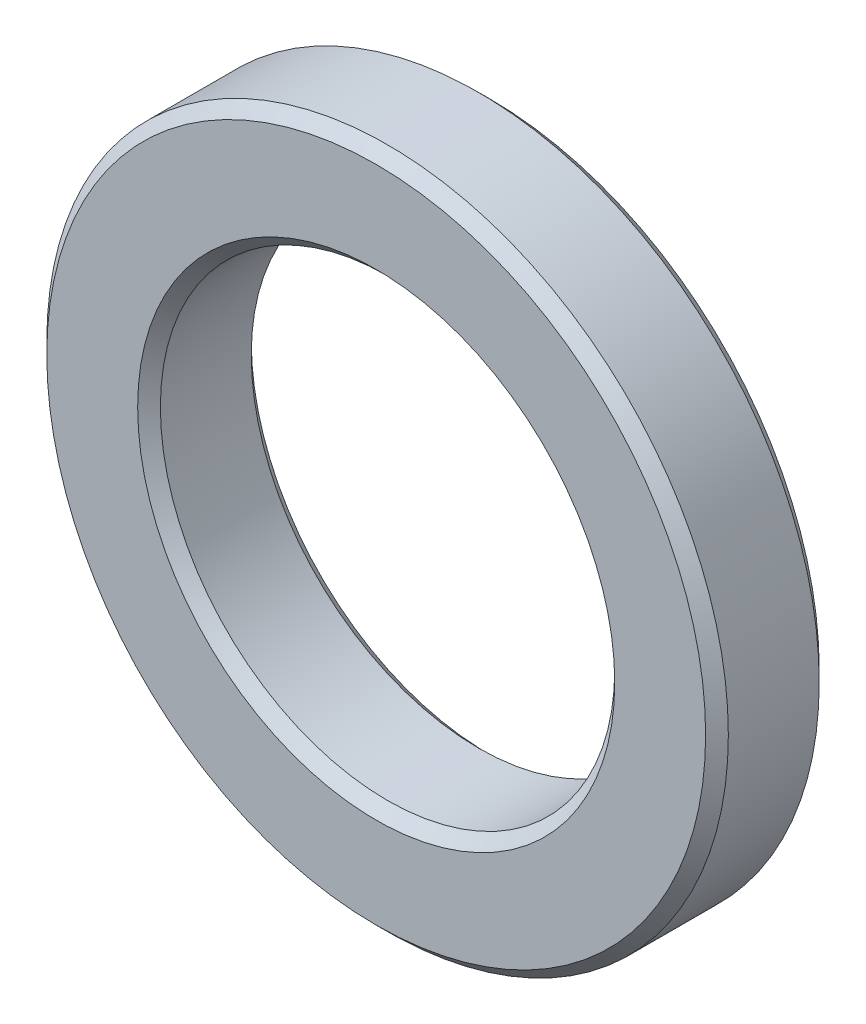
ISO-10303-21;
HEADER;
FILE_DESCRIPTION(('STEP AP214'),'2;1');
FILE_NAME('part.step','',(''),(''),'','','');
FILE_SCHEMA(('AUTOMOTIVE_DESIGN { 1 0 10303 214 1 1 1 1 }'));
ENDSEC;
DATA;
#1=APPLICATION_CONTEXT('core data for automotive mechanical design processes');
#2=APPLICATION_PROTOCOL_DEFINITION('international standard','automotive_design',2000,#1);
#3=PRODUCT_CONTEXT('',#1,'mechanical');
#4=PRODUCT('Part','Part','',(#3));
#5=PRODUCT_RELATED_PRODUCT_CATEGORY('part','',(#4));
#6=PRODUCT_DEFINITION_FORMATION('','',#4);
#7=PRODUCT_DEFINITION_CONTEXT('part definition',#1,'design');
#8=PRODUCT_DEFINITION('design','',#6,#7);
#9=PRODUCT_DEFINITION_SHAPE('','',#8);
#10=(LENGTH_UNIT() NAMED_UNIT(*) SI_UNIT(.MILLI.,.METRE.));
#11=(NAMED_UNIT(*) PLANE_ANGLE_UNIT() SI_UNIT($,.RADIAN.));
#12=(NAMED_UNIT(*) SI_UNIT($,.STERADIAN.) SOLID_ANGLE_UNIT());
#13=UNCERTAINTY_MEASURE_WITH_UNIT(LENGTH_MEASURE(1.E-05),#10,'distance_accuracy_value','');
#14=(GEOMETRIC_REPRESENTATION_CONTEXT(3) GLOBAL_UNCERTAINTY_ASSIGNED_CONTEXT((#13)) GLOBAL_UNIT_ASSIGNED_CONTEXT((#10,
#11,#12)) REPRESENTATION_CONTEXT('',''));
#15=CARTESIAN_POINT('',(0.,0.,0.));
#16=DIRECTION('',(0.,0.,1.));
#17=DIRECTION('',(1.,0.,0.));
#18=AXIS2_PLACEMENT_3D('',#15,#16,#17);
#19=CARTESIAN_POINT('',(0.,0.,1.99999999999996));
#20=DIRECTION('',(0.,0.,0.999999999999999));
#21=DIRECTION('',(1.,0.,0.));
#22=AXIS2_PLACEMENT_3D('',#19,#20,#21);
#23=PLANE('',#22);
#24=CARTESIAN_POINT('',(0.,0.,1.99999999999996));
#25=DIRECTION('',(0.,0.,0.999999999999999));
#26=DIRECTION('',(1.,0.,0.));
#27=AXIS2_PLACEMENT_3D('',#24,#25,#26);
#28=CIRCLE('',#27,5.8);
#29=CARTESIAN_POINT('',(5.79999999999997,0.,1.99999999999996));
#30=VERTEX_POINT('',#29);
#31=EDGE_CURVE('E43',#30,#30,#28,.T.);
#32=ORIENTED_EDGE('',*,*,#31,.T.);
#33=EDGE_LOOP('',(#32));
#34=FACE_BOUND('',#33,.T.);
#35=CARTESIAN_POINT('',(0.,0.,1.99999999999996));
#36=DIRECTION('',(0.,0.,0.999999999999999));
#37=DIRECTION('',(1.,0.,0.));
#38=AXIS2_PLACEMENT_3D('',#35,#36,#37);
#39=CIRCLE('',#38,4.2);
#40=CARTESIAN_POINT('',(4.19999999999997,0.,1.99999999999996));
#41=VERTEX_POINT('',#40);
#42=EDGE_CURVE('E47',#41,#41,#39,.F.);
#43=ORIENTED_EDGE('',*,*,#42,.T.);
#44=EDGE_LOOP('',(#43));
#45=FACE_BOUND('',#44,.T.);
#46=ADVANCED_FACE('F32',(#34,#45),#23,.T.);
#47=CARTESIAN_POINT('',(0.,0.,0.));
#48=DIRECTION('',(0.,0.,0.999999999999999));
#49=DIRECTION('',(1.,0.,0.));
#50=AXIS2_PLACEMENT_3D('',#47,#48,#49);
#51=PLANE('',#50);
#52=CARTESIAN_POINT('',(0.,0.,0.));
#53=DIRECTION('',(0.,0.,0.999999999999999));
#54=DIRECTION('',(1.,0.,0.));
#55=AXIS2_PLACEMENT_3D('',#52,#53,#54);
#56=CIRCLE('',#55,5.8);
#57=CARTESIAN_POINT('',(5.8,0.,0.));
#58=VERTEX_POINT('',#57);
#59=EDGE_CURVE('E52',#58,#58,#56,.F.);
#60=ORIENTED_EDGE('',*,*,#59,.T.);
#61=EDGE_LOOP('',(#60));
#62=FACE_BOUND('',#61,.T.);
#63=CARTESIAN_POINT('',(0.,0.,0.));
#64=DIRECTION('',(0.,0.,0.999999999999999));
#65=DIRECTION('',(1.,0.,0.));
#66=AXIS2_PLACEMENT_3D('',#63,#64,#65);
#67=CIRCLE('',#66,4.2);
#68=CARTESIAN_POINT('',(4.2,0.,0.));
#69=VERTEX_POINT('',#68);
#70=EDGE_CURVE('E55',#69,#69,#67,.T.);
#71=ORIENTED_EDGE('',*,*,#70,.T.);
#72=EDGE_LOOP('',(#71));
#73=FACE_BOUND('',#72,.T.);
#74=ADVANCED_FACE('F77',(#62,#73),#51,.F.);
#75=CARTESIAN_POINT('',(0.,0.,1.99999999999996));
#76=DIRECTION('',(0.,0.,-0.999999999999999));
#77=DIRECTION('',(-1.,0.,0.));
#78=AXIS2_PLACEMENT_3D('',#75,#76,#77);
#79=CYLINDRICAL_SURFACE('',#78,6.);
#80=CARTESIAN_POINT('',(0.,-1.66533453693773E-13,0.200000000000006));
#81=DIRECTION('',(0.,0.,0.999999999999999));
#82=DIRECTION('',(1.,0.,0.));
#83=AXIS2_PLACEMENT_3D('',#80,#81,#82);
#84=CIRCLE('',#83,6.);
#85=CARTESIAN_POINT('',(6.,-1.66533453693773E-13,0.200000000000006));
#86=VERTEX_POINT('',#85);
#87=EDGE_CURVE('E58',#86,#86,#84,.T.);
#88=ORIENTED_EDGE('',*,*,#87,.T.);
#89=EDGE_LOOP('',(#88));
#90=FACE_BOUND('',#89,.T.);
#91=CARTESIAN_POINT('',(0.,-1.11022302462516E-13,1.80000000000001));
#92=DIRECTION('',(0.,0.,0.999999999999999));
#93=DIRECTION('',(1.,0.,0.));
#94=AXIS2_PLACEMENT_3D('',#91,#92,#93);
#95=CIRCLE('',#94,6.);
#96=CARTESIAN_POINT('',(5.99999999999994,-1.11022302462516E-13,1.80000000000001));
#97=VERTEX_POINT('',#96);
#98=EDGE_CURVE('E61',#97,#97,#95,.F.);
#99=ORIENTED_EDGE('',*,*,#98,.T.);
#100=EDGE_LOOP('',(#99));
#101=FACE_BOUND('',#100,.T.);
#102=ADVANCED_FACE('F65',(#90,#101),#79,.T.);
#103=CARTESIAN_POINT('',(0.,0.,1.99999999999996));
#104=DIRECTION('',(0.,0.,-0.999999999999999));
#105=DIRECTION('',(-1.,0.,0.));
#106=AXIS2_PLACEMENT_3D('',#103,#104,#105);
#107=CYLINDRICAL_SURFACE('',#106,4.);
#108=CARTESIAN_POINT('',(0.,-1.11022302462516E-13,1.80000000000001));
#109=DIRECTION('',(0.,0.,0.999999999999999));
#110=DIRECTION('',(1.,0.,0.));
#111=AXIS2_PLACEMENT_3D('',#108,#109,#110);
#112=CIRCLE('',#111,4.);
#113=CARTESIAN_POINT('',(3.99999999999994,-1.11022302462516E-13,1.80000000000001));
#114=VERTEX_POINT('',#113);
#115=EDGE_CURVE('E10',#114,#114,#112,.T.);
#116=ORIENTED_EDGE('',*,*,#115,.T.);
#117=EDGE_LOOP('',(#116));
#118=FACE_BOUND('',#117,.T.);
#119=CARTESIAN_POINT('',(0.,-1.66533453693773E-13,0.200000000000006));
#120=DIRECTION('',(0.,0.,0.999999999999999));
#121=DIRECTION('',(1.,0.,0.));
#122=AXIS2_PLACEMENT_3D('',#119,#120,#121);
#123=CIRCLE('',#122,4.);
#124=CARTESIAN_POINT('',(4.,-1.66533453693773E-13,0.200000000000006));
#125=VERTEX_POINT('',#124);
#126=EDGE_CURVE('E39',#125,#125,#123,.F.);
#127=ORIENTED_EDGE('',*,*,#126,.T.);
#128=EDGE_LOOP('',(#127));
#129=FACE_BOUND('',#128,.T.);
#130=ADVANCED_FACE('F90',(#118,#129),#107,.F.);
#131=CARTESIAN_POINT('',(0.,-1.66533453693773E-13,0.200000000000006));
#132=DIRECTION('',(0.,0.,0.999999999999999));
#133=DIRECTION('',(1.,0.,0.));
#134=AXIS2_PLACEMENT_3D('',#131,#132,#133);
#135=CONICAL_SURFACE('',#134,6.,0.78539816339745);
#136=ORIENTED_EDGE('',*,*,#59,.F.);
#137=EDGE_LOOP('',(#136));
#138=FACE_BOUND('',#137,.T.);
#139=ORIENTED_EDGE('',*,*,#87,.F.);
#140=EDGE_LOOP('',(#139));
#141=FACE_BOUND('',#140,.T.);
#142=ADVANCED_FACE('F71',(#138,#141),#135,.T.);
#143=CARTESIAN_POINT('',(0.,0.,1.99999999999996));
#144=DIRECTION('',(0.,0.,-0.999999999999999));
#145=DIRECTION('',(-1.,0.,0.));
#146=AXIS2_PLACEMENT_3D('',#143,#144,#145);
#147=CONICAL_SURFACE('',#146,5.8,0.785398163397444);
#148=ORIENTED_EDGE('',*,*,#98,.F.);
#149=EDGE_LOOP('',(#148));
#150=FACE_BOUND('',#149,.T.);
#151=ORIENTED_EDGE('',*,*,#31,.F.);
#152=EDGE_LOOP('',(#151));
#153=FACE_BOUND('',#152,.T.);
#154=ADVANCED_FACE('F67',(#150,#153),#147,.T.);
#155=CARTESIAN_POINT('',(0.,-1.11022302462516E-13,1.80000000000001));
#156=DIRECTION('',(0.,0.,0.999999999999999));
#157=DIRECTION('',(1.,0.,0.));
#158=AXIS2_PLACEMENT_3D('',#155,#156,#157);
#159=CONICAL_SURFACE('',#158,4.,0.785398163397448);
#160=ORIENTED_EDGE('',*,*,#42,.F.);
#161=EDGE_LOOP('',(#160));
#162=FACE_BOUND('',#161,.T.);
#163=ORIENTED_EDGE('',*,*,#115,.F.);
#164=EDGE_LOOP('',(#163));
#165=FACE_BOUND('',#164,.T.);
#166=ADVANCED_FACE('F70',(#162,#165),#159,.F.);
#167=CARTESIAN_POINT('',(0.,0.,0.));
#168=DIRECTION('',(0.,0.,-0.999999999999999));
#169=DIRECTION('',(-1.,0.,0.));
#170=AXIS2_PLACEMENT_3D('',#167,#168,#169);
#171=CONICAL_SURFACE('',#170,4.2,0.785398163397444);
#172=ORIENTED_EDGE('',*,*,#126,.F.);
#173=EDGE_LOOP('',(#172));
#174=FACE_BOUND('',#173,.T.);
#175=ORIENTED_EDGE('',*,*,#70,.F.);
#176=EDGE_LOOP('',(#175));
#177=FACE_BOUND('',#176,.T.);
#178=ADVANCED_FACE('F34',(#174,#177),#171,.F.);
#179=CLOSED_SHELL('',(#46,#74,#102,#130,#142,#154,#166,#178));
#180=MANIFOLD_SOLID_BREP('B2',#179);
#181=ADVANCED_BREP_SHAPE_REPRESENTATION('',(#18,#180),#14);
#182=SHAPE_DEFINITION_REPRESENTATION(#9,#181);
ENDSEC;
END-ISO-10303-21;
